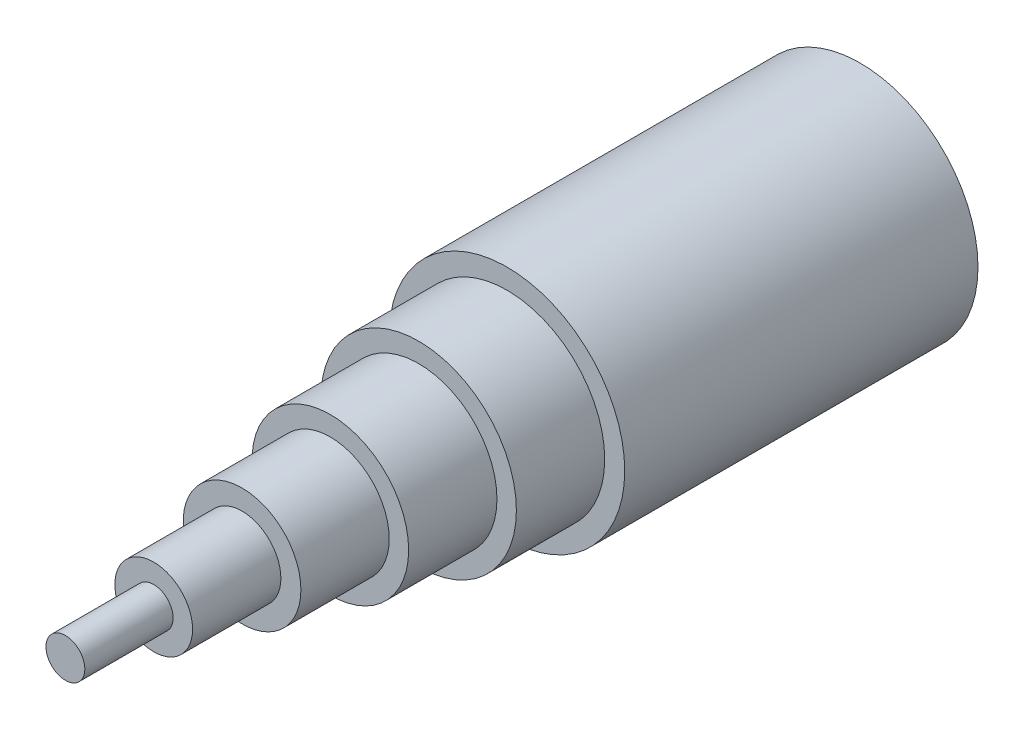
ISO-10303-21;
HEADER;
FILE_DESCRIPTION(('STEP AP214'),'2;1');
FILE_NAME('part.step','',(''),(''),'','','');
FILE_SCHEMA(('AUTOMOTIVE_DESIGN { 1 0 10303 214 1 1 1 1 }'));
ENDSEC;
DATA;
#1=APPLICATION_CONTEXT('core data for automotive mechanical design processes');
#2=APPLICATION_PROTOCOL_DEFINITION('international standard','automotive_design',2000,#1);
#3=PRODUCT_CONTEXT('',#1,'mechanical');
#4=PRODUCT('Part','Part','',(#3));
#5=PRODUCT_RELATED_PRODUCT_CATEGORY('part','',(#4));
#6=PRODUCT_DEFINITION_FORMATION('','',#4);
#7=PRODUCT_DEFINITION_CONTEXT('part definition',#1,'design');
#8=PRODUCT_DEFINITION('design','',#6,#7);
#9=PRODUCT_DEFINITION_SHAPE('','',#8);
#10=(LENGTH_UNIT() NAMED_UNIT(*) SI_UNIT(.MILLI.,.METRE.));
#11=(NAMED_UNIT(*) PLANE_ANGLE_UNIT() SI_UNIT($,.RADIAN.));
#12=(NAMED_UNIT(*) SI_UNIT($,.STERADIAN.) SOLID_ANGLE_UNIT());
#13=UNCERTAINTY_MEASURE_WITH_UNIT(LENGTH_MEASURE(1.E-05),#10,'distance_accuracy_value','');
#14=(GEOMETRIC_REPRESENTATION_CONTEXT(3) GLOBAL_UNCERTAINTY_ASSIGNED_CONTEXT((#13)) GLOBAL_UNIT_ASSIGNED_CONTEXT((#10,
#11,#12)) REPRESENTATION_CONTEXT('',''));
#15=CARTESIAN_POINT('',(0.,0.,0.));
#16=DIRECTION('',(0.,0.,1.));
#17=DIRECTION('',(1.,0.,0.));
#18=AXIS2_PLACEMENT_3D('',#15,#16,#17);
#19=CARTESIAN_POINT('',(0.,0.,6.));
#20=DIRECTION('',(0.,0.,-1.));
#21=DIRECTION('',(-1.,0.,0.));
#22=AXIS2_PLACEMENT_3D('',#19,#20,#21);
#23=CYLINDRICAL_SURFACE('',#22,0.33);
#24=CARTESIAN_POINT('',(0.,0.,5.25));
#25=DIRECTION('',(0.,0.,1.));
#26=DIRECTION('',(1.,0.,0.));
#27=AXIS2_PLACEMENT_3D('',#24,#25,#26);
#28=CIRCLE('',#27,0.33);
#29=CARTESIAN_POINT('',(0.33,0.,5.25));
#30=VERTEX_POINT('',#29);
#31=EDGE_CURVE('E65',#30,#30,#28,.T.);
#32=ORIENTED_EDGE('',*,*,#31,.T.);
#33=EDGE_LOOP('',(#32));
#34=FACE_BOUND('',#33,.T.);
#35=CARTESIAN_POINT('',(0.,0.,6.));
#36=DIRECTION('',(0.,0.,1.));
#37=DIRECTION('',(1.,0.,0.));
#38=AXIS2_PLACEMENT_3D('',#35,#36,#37);
#39=CIRCLE('',#38,0.33);
#40=CARTESIAN_POINT('',(0.33,0.,6.));
#41=VERTEX_POINT('',#40);
#42=EDGE_CURVE('E52',#41,#41,#39,.T.);
#43=ORIENTED_EDGE('',*,*,#42,.F.);
#44=EDGE_LOOP('',(#43));
#45=FACE_BOUND('',#44,.T.);
#46=ADVANCED_FACE('F39',(#34,#45),#23,.T.);
#47=CARTESIAN_POINT('',(0.,0.,6.));
#48=DIRECTION('',(0.,0.,1.));
#49=DIRECTION('',(1.,0.,0.));
#50=AXIS2_PLACEMENT_3D('',#47,#48,#49);
#51=PLANE('',#50);
#52=CARTESIAN_POINT('',(0.,0.,6.));
#53=DIRECTION('',(0.,0.,1.));
#54=DIRECTION('',(1.,0.,0.));
#55=AXIS2_PLACEMENT_3D('',#52,#53,#54);
#56=CIRCLE('',#55,0.165);
#57=CARTESIAN_POINT('',(0.165,0.,6.));
#58=VERTEX_POINT('',#57);
#59=EDGE_CURVE('E57',#58,#58,#56,.T.);
#60=ORIENTED_EDGE('',*,*,#59,.F.);
#61=EDGE_LOOP('',(#60));
#62=FACE_BOUND('',#61,.T.);
#63=ORIENTED_EDGE('',*,*,#42,.T.);
#64=EDGE_LOOP('',(#63));
#65=FACE_BOUND('',#64,.T.);
#66=ADVANCED_FACE('F110',(#62,#65),#51,.T.);
#67=CARTESIAN_POINT('',(0.,0.,5.25));
#68=DIRECTION('',(0.,0.,-1.));
#69=DIRECTION('',(-1.,0.,0.));
#70=AXIS2_PLACEMENT_3D('',#67,#68,#69);
#71=CYLINDRICAL_SURFACE('',#70,0.5);
#72=CARTESIAN_POINT('',(0.,0.,4.5));
#73=DIRECTION('',(0.,0.,1.));
#74=DIRECTION('',(1.,0.,0.));
#75=AXIS2_PLACEMENT_3D('',#72,#73,#74);
#76=CIRCLE('',#75,0.5);
#77=CARTESIAN_POINT('',(0.5,0.,4.5));
#78=VERTEX_POINT('',#77);
#79=EDGE_CURVE('E73',#78,#78,#76,.T.);
#80=ORIENTED_EDGE('',*,*,#79,.T.);
#81=EDGE_LOOP('',(#80));
#82=FACE_BOUND('',#81,.T.);
#83=CARTESIAN_POINT('',(0.,0.,5.25));
#84=DIRECTION('',(0.,0.,1.));
#85=DIRECTION('',(1.,0.,0.));
#86=AXIS2_PLACEMENT_3D('',#83,#84,#85);
#87=CIRCLE('',#86,0.5);
#88=CARTESIAN_POINT('',(0.5,0.,5.25));
#89=VERTEX_POINT('',#88);
#90=EDGE_CURVE('E61',#89,#89,#87,.T.);
#91=ORIENTED_EDGE('',*,*,#90,.F.);
#92=EDGE_LOOP('',(#91));
#93=FACE_BOUND('',#92,.T.);
#94=ADVANCED_FACE('F116',(#82,#93),#71,.T.);
#95=CARTESIAN_POINT('',(0.,0.,5.25));
#96=DIRECTION('',(0.,0.,1.));
#97=DIRECTION('',(1.,0.,0.));
#98=AXIS2_PLACEMENT_3D('',#95,#96,#97);
#99=PLANE('',#98);
#100=ORIENTED_EDGE('',*,*,#31,.F.);
#101=EDGE_LOOP('',(#100));
#102=FACE_BOUND('',#101,.T.);
#103=ORIENTED_EDGE('',*,*,#90,.T.);
#104=EDGE_LOOP('',(#103));
#105=FACE_BOUND('',#104,.T.);
#106=ADVANCED_FACE('F149',(#102,#105),#99,.T.);
#107=CARTESIAN_POINT('',(0.,0.,4.5));
#108=DIRECTION('',(0.,0.,-1.));
#109=DIRECTION('',(-1.,0.,0.));
#110=AXIS2_PLACEMENT_3D('',#107,#108,#109);
#111=CYLINDRICAL_SURFACE('',#110,0.665);
#112=CARTESIAN_POINT('',(0.,0.,3.75));
#113=DIRECTION('',(0.,0.,1.));
#114=DIRECTION('',(1.,0.,0.));
#115=AXIS2_PLACEMENT_3D('',#112,#113,#114);
#116=CIRCLE('',#115,0.665);
#117=CARTESIAN_POINT('',(0.665,0.,3.75));
#118=VERTEX_POINT('',#117);
#119=EDGE_CURVE('E82',#118,#118,#116,.T.);
#120=ORIENTED_EDGE('',*,*,#119,.T.);
#121=EDGE_LOOP('',(#120));
#122=FACE_BOUND('',#121,.T.);
#123=CARTESIAN_POINT('',(0.,0.,4.5));
#124=DIRECTION('',(0.,0.,1.));
#125=DIRECTION('',(1.,0.,0.));
#126=AXIS2_PLACEMENT_3D('',#123,#124,#125);
#127=CIRCLE('',#126,0.665);
#128=CARTESIAN_POINT('',(0.665,0.,4.5));
#129=VERTEX_POINT('',#128);
#130=EDGE_CURVE('E69',#129,#129,#127,.T.);
#131=ORIENTED_EDGE('',*,*,#130,.F.);
#132=EDGE_LOOP('',(#131));
#133=FACE_BOUND('',#132,.T.);
#134=ADVANCED_FACE('F145',(#122,#133),#111,.T.);
#135=CARTESIAN_POINT('',(0.,0.,4.5));
#136=DIRECTION('',(0.,0.,1.));
#137=DIRECTION('',(1.,0.,0.));
#138=AXIS2_PLACEMENT_3D('',#135,#136,#137);
#139=PLANE('',#138);
#140=ORIENTED_EDGE('',*,*,#79,.F.);
#141=EDGE_LOOP('',(#140));
#142=FACE_BOUND('',#141,.T.);
#143=ORIENTED_EDGE('',*,*,#130,.T.);
#144=EDGE_LOOP('',(#143));
#145=FACE_BOUND('',#144,.T.);
#146=ADVANCED_FACE('F137',(#142,#145),#139,.T.);
#147=CARTESIAN_POINT('',(0.,0.,3.75));
#148=DIRECTION('',(0.,0.,-1.));
#149=DIRECTION('',(-1.,0.,0.));
#150=AXIS2_PLACEMENT_3D('',#147,#148,#149);
#151=CYLINDRICAL_SURFACE('',#150,0.83);
#152=CARTESIAN_POINT('',(0.,0.,3.75));
#153=DIRECTION('',(0.,0.,1.));
#154=DIRECTION('',(1.,0.,0.));
#155=AXIS2_PLACEMENT_3D('',#152,#153,#154);
#156=CIRCLE('',#155,0.83);
#157=CARTESIAN_POINT('',(0.83,0.,3.75));
#158=VERTEX_POINT('',#157);
#159=EDGE_CURVE('E77',#158,#158,#156,.T.);
#160=ORIENTED_EDGE('',*,*,#159,.F.);
#161=EDGE_LOOP('',(#160));
#162=FACE_BOUND('',#161,.T.);
#163=CARTESIAN_POINT('',(0.,0.,3.));
#164=DIRECTION('',(0.,0.,1.));
#165=DIRECTION('',(1.,0.,0.));
#166=AXIS2_PLACEMENT_3D('',#163,#164,#165);
#167=CIRCLE('',#166,0.83);
#168=CARTESIAN_POINT('',(0.83,0.,3.));
#169=VERTEX_POINT('',#168);
#170=EDGE_CURVE('E78',#169,#169,#167,.T.);
#171=ORIENTED_EDGE('',*,*,#170,.T.);
#172=EDGE_LOOP('',(#171));
#173=FACE_BOUND('',#172,.T.);
#174=ADVANCED_FACE('F130',(#162,#173),#151,.T.);
#175=CARTESIAN_POINT('',(0.,0.,3.75));
#176=DIRECTION('',(0.,0.,1.));
#177=DIRECTION('',(1.,0.,0.));
#178=AXIS2_PLACEMENT_3D('',#175,#176,#177);
#179=PLANE('',#178);
#180=ORIENTED_EDGE('',*,*,#119,.F.);
#181=EDGE_LOOP('',(#180));
#182=FACE_BOUND('',#181,.T.);
#183=ORIENTED_EDGE('',*,*,#159,.T.);
#184=EDGE_LOOP('',(#183));
#185=FACE_BOUND('',#184,.T.);
#186=ADVANCED_FACE('F123',(#182,#185),#179,.T.);
#187=CARTESIAN_POINT('',(0.,0.,0.));
#188=DIRECTION('',(0.,0.,1.));
#189=DIRECTION('',(1.,0.,0.));
#190=AXIS2_PLACEMENT_3D('',#187,#188,#189);
#191=PLANE('',#190);
#192=CARTESIAN_POINT('',(0.,0.,0.));
#193=DIRECTION('',(0.,0.,1.));
#194=DIRECTION('',(1.,0.,0.));
#195=AXIS2_PLACEMENT_3D('',#192,#193,#194);
#196=CIRCLE('',#195,1.);
#197=CARTESIAN_POINT('',(1.,0.,0.));
#198=VERTEX_POINT('',#197);
#199=EDGE_CURVE('E43',#198,#198,#196,.T.);
#200=ORIENTED_EDGE('',*,*,#199,.F.);
#201=EDGE_LOOP('',(#200));
#202=FACE_BOUND('',#201,.T.);
#203=ADVANCED_FACE('F121',(#202),#191,.F.);
#204=CARTESIAN_POINT('',(0.,0.,3.));
#205=DIRECTION('',(0.,0.,-1.));
#206=DIRECTION('',(-1.,0.,0.));
#207=AXIS2_PLACEMENT_3D('',#204,#205,#206);
#208=CYLINDRICAL_SURFACE('',#207,1.);
#209=CARTESIAN_POINT('',(0.,0.,3.));
#210=DIRECTION('',(0.,0.,1.));
#211=DIRECTION('',(1.,0.,0.));
#212=AXIS2_PLACEMENT_3D('',#209,#210,#211);
#213=CIRCLE('',#212,1.);
#214=CARTESIAN_POINT('',(1.,0.,3.));
#215=VERTEX_POINT('',#214);
#216=EDGE_CURVE('E10',#215,#215,#213,.T.);
#217=ORIENTED_EDGE('',*,*,#216,.F.);
#218=EDGE_LOOP('',(#217));
#219=FACE_BOUND('',#218,.T.);
#220=ORIENTED_EDGE('',*,*,#199,.T.);
#221=EDGE_LOOP('',(#220));
#222=FACE_BOUND('',#221,.T.);
#223=ADVANCED_FACE('F41',(#219,#222),#208,.T.);
#224=CARTESIAN_POINT('',(0.,0.,3.));
#225=DIRECTION('',(0.,0.,1.));
#226=DIRECTION('',(1.,0.,0.));
#227=AXIS2_PLACEMENT_3D('',#224,#225,#226);
#228=PLANE('',#227);
#229=ORIENTED_EDGE('',*,*,#170,.F.);
#230=EDGE_LOOP('',(#229));
#231=FACE_BOUND('',#230,.T.);
#232=ORIENTED_EDGE('',*,*,#216,.T.);
#233=EDGE_LOOP('',(#232));
#234=FACE_BOUND('',#233,.T.);
#235=ADVANCED_FACE('F98',(#231,#234),#228,.T.);
#236=CARTESIAN_POINT('',(0.,0.,6.75));
#237=DIRECTION('',(0.,0.,-1.));
#238=DIRECTION('',(-1.,0.,0.));
#239=AXIS2_PLACEMENT_3D('',#236,#237,#238);
#240=CYLINDRICAL_SURFACE('',#239,0.165);
#241=ORIENTED_EDGE('',*,*,#59,.T.);
#242=EDGE_LOOP('',(#241));
#243=FACE_BOUND('',#242,.T.);
#244=CARTESIAN_POINT('',(0.,0.,6.75));
#245=DIRECTION('',(0.,0.,1.));
#246=DIRECTION('',(1.,0.,0.));
#247=AXIS2_PLACEMENT_3D('',#244,#245,#246);
#248=CIRCLE('',#247,0.165);
#249=CARTESIAN_POINT('',(0.165,0.,6.75));
#250=VERTEX_POINT('',#249);
#251=EDGE_CURVE('E83',#250,#250,#248,.T.);
#252=ORIENTED_EDGE('',*,*,#251,.F.);
#253=EDGE_LOOP('',(#252));
#254=FACE_BOUND('',#253,.T.);
#255=ADVANCED_FACE('F96',(#243,#254),#240,.T.);
#256=CARTESIAN_POINT('',(0.,0.,6.75));
#257=DIRECTION('',(0.,0.,1.));
#258=DIRECTION('',(1.,0.,0.));
#259=AXIS2_PLACEMENT_3D('',#256,#257,#258);
#260=PLANE('',#259);
#261=ORIENTED_EDGE('',*,*,#251,.T.);
#262=EDGE_LOOP('',(#261));
#263=FACE_BOUND('',#262,.T.);
#264=ADVANCED_FACE('F94',(#263),#260,.T.);
#265=CLOSED_SHELL('',(#46,#66,#94,#106,#134,#146,#174,#186,#203,#223,#235,#255,#264));
#266=MANIFOLD_SOLID_BREP('B2',#265);
#267=ADVANCED_BREP_SHAPE_REPRESENTATION('',(#18,#266),#14);
#268=SHAPE_DEFINITION_REPRESENTATION(#9,#267);
ENDSEC;
END-ISO-10303-21;
